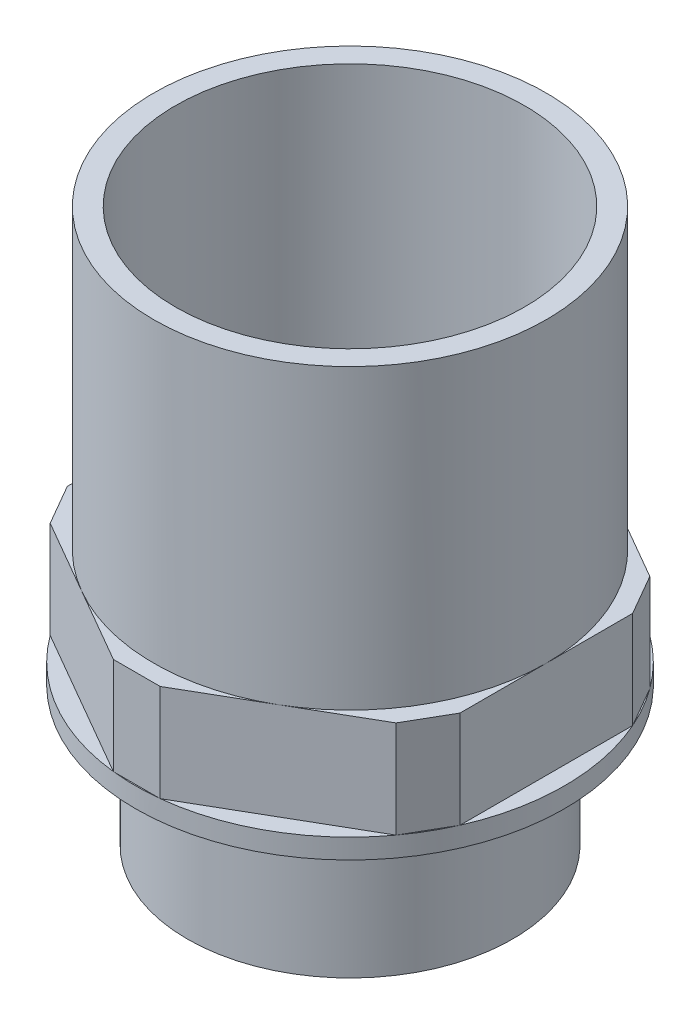
ISO-10303-21;
HEADER;
FILE_DESCRIPTION(('STEP AP214'),'2;1');
FILE_NAME('part.step','',(''),(''),'','','');
FILE_SCHEMA(('AUTOMOTIVE_DESIGN { 1 0 10303 214 1 1 1 1 }'));
ENDSEC;
DATA;
#1=APPLICATION_CONTEXT('core data for automotive mechanical design processes');
#2=APPLICATION_PROTOCOL_DEFINITION('international standard','automotive_design',2000,#1);
#3=PRODUCT_CONTEXT('',#1,'mechanical');
#4=PRODUCT('Part','Part','',(#3));
#5=PRODUCT_RELATED_PRODUCT_CATEGORY('part','',(#4));
#6=PRODUCT_DEFINITION_FORMATION('','',#4);
#7=PRODUCT_DEFINITION_CONTEXT('part definition',#1,'design');
#8=PRODUCT_DEFINITION('design','',#6,#7);
#9=PRODUCT_DEFINITION_SHAPE('','',#8);
#10=(LENGTH_UNIT() NAMED_UNIT(*) SI_UNIT(.MILLI.,.METRE.));
#11=(NAMED_UNIT(*) PLANE_ANGLE_UNIT() SI_UNIT($,.RADIAN.));
#12=(NAMED_UNIT(*) SI_UNIT($,.STERADIAN.) SOLID_ANGLE_UNIT());
#13=UNCERTAINTY_MEASURE_WITH_UNIT(LENGTH_MEASURE(1.E-05),#10,'distance_accuracy_value','');
#14=(GEOMETRIC_REPRESENTATION_CONTEXT(3) GLOBAL_UNCERTAINTY_ASSIGNED_CONTEXT((#13)) GLOBAL_UNIT_ASSIGNED_CONTEXT((#10,
#11,#12)) REPRESENTATION_CONTEXT('',''));
#15=CARTESIAN_POINT('',(0.,0.,0.));
#16=DIRECTION('',(0.,0.,1.));
#17=DIRECTION('',(1.,0.,0.));
#18=AXIS2_PLACEMENT_3D('',#15,#16,#17);
#19=CARTESIAN_POINT('',(-36.2208663317331,32.766,8.12397281117722));
#20=DIRECTION('',(0.,-1.,0.));
#21=DIRECTION('',(0.,0.,-1.));
#22=AXIS2_PLACEMENT_3D('',#19,#20,#21);
#23=PLANE('',#22);
#24=CARTESIAN_POINT('',(0.,32.766,0.));
#25=DIRECTION('',(0.,1.,0.));
#26=DIRECTION('',(0.,0.,1.));
#27=AXIS2_PLACEMENT_3D('',#24,#25,#26);
#28=CIRCLE('',#27,25.146);
#29=CARTESIAN_POINT('',(12.5730000000001,32.766,21.7770748035634));
#30=VERTEX_POINT('',#29);
#31=CARTESIAN_POINT('',(25.146,32.766,0.));
#32=VERTEX_POINT('',#31);
#33=EDGE_CURVE('E43',#30,#32,#28,.T.);
#34=ORIENTED_EDGE('',*,*,#33,.F.);
#35=DIRECTION('',(0.866025403784436,0.,-0.500000000000004));
#36=VECTOR('',#35,1.);
#37=CARTESIAN_POINT('',(22.1497326634662,32.766,16.2479456223541));
#38=LINE('',#37,#36);
#39=CARTESIAN_POINT('',(22.1497326634662,32.766,16.2479456223541));
#40=VERTEX_POINT('',#39);
#41=EDGE_CURVE('E154',#30,#40,#38,.T.);
#42=ORIENTED_EDGE('',*,*,#41,.T.);
#43=DIRECTION('',(0.499999999999998,0.,-0.86602540378444));
#44=VECTOR('',#43,1.);
#45=CARTESIAN_POINT('',(22.1497326634662,32.766,16.2479456223541));
#46=LINE('',#45,#44);
#47=CARTESIAN_POINT('',(25.146,32.766,11.0582583624186));
#48=VERTEX_POINT('',#47);
#49=EDGE_CURVE('E153',#40,#48,#46,.T.);
#50=ORIENTED_EDGE('',*,*,#49,.T.);
#51=DIRECTION('',(0.,0.,-1.));
#52=VECTOR('',#51,1.);
#53=CARTESIAN_POINT('',(25.146,32.766,-11.0582583624186));
#54=LINE('',#53,#52);
#55=EDGE_CURVE('E167',#48,#32,#54,.T.);
#56=ORIENTED_EDGE('',*,*,#55,.T.);
#57=EDGE_LOOP('',(#34,#42,#50,#56));
#58=FACE_BOUND('',#57,.T.);
#59=ADVANCED_FACE('F32',(#58),#23,.F.);
#60=CARTESIAN_POINT('',(12.573,32.766,-21.7770748035635));
#61=VERTEX_POINT('',#60);
#62=EDGE_CURVE('E11',#32,#61,#28,.T.);
#63=ORIENTED_EDGE('',*,*,#62,.F.);
#64=CARTESIAN_POINT('',(25.146,32.766,-11.0582583624186));
#65=VERTEX_POINT('',#64);
#66=EDGE_CURVE('E231',#32,#65,#54,.T.);
#67=ORIENTED_EDGE('',*,*,#66,.T.);
#68=DIRECTION('',(-0.500000000000001,0.,-0.866025403784438));
#69=VECTOR('',#68,1.);
#70=CARTESIAN_POINT('',(22.1497326634661,32.766,-16.2479456223543));
#71=LINE('',#70,#69);
#72=CARTESIAN_POINT('',(22.1497326634661,32.766,-16.2479456223543));
#73=VERTEX_POINT('',#72);
#74=EDGE_CURVE('E233',#65,#73,#71,.T.);
#75=ORIENTED_EDGE('',*,*,#74,.T.);
#76=DIRECTION('',(-0.86602540378444,0.,-0.499999999999998));
#77=VECTOR('',#76,1.);
#78=CARTESIAN_POINT('',(2.99626733653379,32.766,-27.3062039847728));
#79=LINE('',#78,#77);
#80=EDGE_CURVE('E236',#73,#61,#79,.T.);
#81=ORIENTED_EDGE('',*,*,#80,.T.);
#82=EDGE_LOOP('',(#63,#67,#75,#81));
#83=FACE_BOUND('',#82,.T.);
#84=ADVANCED_FACE('F305',(#83),#23,.F.);
#85=CARTESIAN_POINT('',(-12.5730000000001,32.766,-21.7770748035634));
#86=VERTEX_POINT('',#85);
#87=EDGE_CURVE('E41',#61,#86,#28,.T.);
#88=ORIENTED_EDGE('',*,*,#87,.F.);
#89=CARTESIAN_POINT('',(2.99626733653379,32.766,-27.3062039847728));
#90=VERTEX_POINT('',#89);
#91=EDGE_CURVE('E235',#61,#90,#79,.T.);
#92=ORIENTED_EDGE('',*,*,#91,.T.);
#93=DIRECTION('',(-1.,0.,0.));
#94=VECTOR('',#93,1.);
#95=CARTESIAN_POINT('',(-2.99626733653402,32.766,-27.3062039847728));
#96=LINE('',#95,#94);
#97=CARTESIAN_POINT('',(-2.99626733653402,32.766,-27.3062039847728));
#98=VERTEX_POINT('',#97);
#99=EDGE_CURVE('E239',#90,#98,#96,.T.);
#100=ORIENTED_EDGE('',*,*,#99,.T.);
#101=DIRECTION('',(-0.866025403784436,0.,0.500000000000005));
#102=VECTOR('',#101,1.);
#103=CARTESIAN_POINT('',(-2.99626733653402,32.766,-27.3062039847728));
#104=LINE('',#103,#102);
#105=EDGE_CURVE('E242',#98,#86,#104,.T.);
#106=ORIENTED_EDGE('',*,*,#105,.T.);
#107=EDGE_LOOP('',(#88,#92,#100,#106));
#108=FACE_BOUND('',#107,.T.);
#109=ADVANCED_FACE('F310',(#108),#23,.F.);
#110=CARTESIAN_POINT('',(-25.146,32.766,0.));
#111=VERTEX_POINT('',#110);
#112=EDGE_CURVE('E50',#86,#111,#28,.T.);
#113=ORIENTED_EDGE('',*,*,#112,.F.);
#114=CARTESIAN_POINT('',(-22.1497326634662,32.766,-16.2479456223541));
#115=VERTEX_POINT('',#114);
#116=EDGE_CURVE('E241',#86,#115,#104,.T.);
#117=ORIENTED_EDGE('',*,*,#116,.T.);
#118=DIRECTION('',(-0.499999999999997,0.,0.86602540378444));
#119=VECTOR('',#118,1.);
#120=CARTESIAN_POINT('',(-25.146,32.766,-11.0582583624186));
#121=LINE('',#120,#119);
#122=CARTESIAN_POINT('',(-25.146,32.766,-11.0582583624186));
#123=VERTEX_POINT('',#122);
#124=EDGE_CURVE('E217',#115,#123,#121,.T.);
#125=ORIENTED_EDGE('',*,*,#124,.T.);
#126=DIRECTION('',(0.,0.,1.));
#127=VECTOR('',#126,1.);
#128=CARTESIAN_POINT('',(-25.146,32.766,-11.0582583624186));
#129=LINE('',#128,#127);
#130=EDGE_CURVE('E221',#123,#111,#129,.T.);
#131=ORIENTED_EDGE('',*,*,#130,.T.);
#132=EDGE_LOOP('',(#113,#117,#125,#131));
#133=FACE_BOUND('',#132,.T.);
#134=ADVANCED_FACE('F325',(#133),#23,.F.);
#135=CARTESIAN_POINT('',(-12.573,32.766,21.7770748035636));
#136=VERTEX_POINT('',#135);
#137=EDGE_CURVE('E173',#111,#136,#28,.T.);
#138=ORIENTED_EDGE('',*,*,#137,.F.);
#139=CARTESIAN_POINT('',(-25.146,32.766,11.0582583624186));
#140=VERTEX_POINT('',#139);
#141=EDGE_CURVE('E220',#111,#140,#129,.T.);
#142=ORIENTED_EDGE('',*,*,#141,.T.);
#143=DIRECTION('',(0.5,0.,0.866025403784438));
#144=VECTOR('',#143,1.);
#145=CARTESIAN_POINT('',(-25.146,32.766,11.0582583624186));
#146=LINE('',#145,#144);
#147=CARTESIAN_POINT('',(-22.1497326634661,32.766,16.2479456223543));
#148=VERTEX_POINT('',#147);
#149=EDGE_CURVE('E223',#140,#148,#146,.T.);
#150=ORIENTED_EDGE('',*,*,#149,.T.);
#151=DIRECTION('',(0.86602540378444,0.,0.499999999999998));
#152=VECTOR('',#151,1.);
#153=CARTESIAN_POINT('',(-22.1497326634661,32.766,16.2479456223543));
#154=LINE('',#153,#152);
#155=EDGE_CURVE('E226',#148,#136,#154,.T.);
#156=ORIENTED_EDGE('',*,*,#155,.T.);
#157=EDGE_LOOP('',(#138,#142,#150,#156));
#158=FACE_BOUND('',#157,.T.);
#159=ADVANCED_FACE('F316',(#158),#23,.F.);
#160=EDGE_CURVE('E146',#136,#30,#28,.T.);
#161=ORIENTED_EDGE('',*,*,#160,.F.);
#162=CARTESIAN_POINT('',(-2.99626733653379,32.766,27.3062039847728));
#163=VERTEX_POINT('',#162);
#164=EDGE_CURVE('E225',#136,#163,#154,.T.);
#165=ORIENTED_EDGE('',*,*,#164,.T.);
#166=DIRECTION('',(1.,0.,0.));
#167=VECTOR('',#166,1.);
#168=CARTESIAN_POINT('',(-2.99626733653379,32.766,27.3062039847728));
#169=LINE('',#168,#167);
#170=CARTESIAN_POINT('',(2.99626733653397,32.766,27.3062039847728));
#171=VERTEX_POINT('',#170);
#172=EDGE_CURVE('E149',#163,#171,#169,.T.);
#173=ORIENTED_EDGE('',*,*,#172,.T.);
#174=EDGE_CURVE('E142',#171,#30,#38,.T.);
#175=ORIENTED_EDGE('',*,*,#174,.T.);
#176=EDGE_LOOP('',(#161,#165,#173,#175));
#177=FACE_BOUND('',#176,.T.);
#178=ADVANCED_FACE('F144',(#177),#23,.F.);
#179=CARTESIAN_POINT('',(0.,20.32,0.));
#180=DIRECTION('',(0.,1.,0.));
#181=DIRECTION('',(0.,0.,1.));
#182=AXIS2_PLACEMENT_3D('',#179,#180,#181);
#183=PLANE('',#182);
#184=DIRECTION('',(-0.499999999999997,0.,0.86602540378444));
#185=VECTOR('',#184,1.);
#186=CARTESIAN_POINT('',(-25.146,20.32,-11.0582583624186));
#187=LINE('',#186,#185);
#188=CARTESIAN_POINT('',(-22.1497326634662,20.32,-16.2479456223542));
#189=VERTEX_POINT('',#188);
#190=CARTESIAN_POINT('',(-25.146,20.32,-11.0582583624186));
#191=VERTEX_POINT('',#190);
#192=EDGE_CURVE('E182',#189,#191,#187,.T.);
#193=ORIENTED_EDGE('',*,*,#192,.F.);
#194=CARTESIAN_POINT('',(0.,20.32,0.));
#195=DIRECTION('',(0.,1.,0.));
#196=DIRECTION('',(0.,0.,1.));
#197=AXIS2_PLACEMENT_3D('',#194,#195,#196);
#198=CIRCLE('',#197,27.4701);
#199=EDGE_CURVE('E679',#189,#191,#198,.T.);
#200=ORIENTED_EDGE('',*,*,#199,.T.);
#201=EDGE_LOOP('',(#193,#200));
#202=FACE_BOUND('',#201,.T.);
#203=ADVANCED_FACE('F315',(#202),#183,.T.);
#204=DIRECTION('',(-0.866025403784436,0.,0.500000000000005));
#205=VECTOR('',#204,1.);
#206=CARTESIAN_POINT('',(-2.99626733653402,20.32,-27.3062039847728));
#207=LINE('',#206,#205);
#208=CARTESIAN_POINT('',(-2.9962673365339,20.32,-27.3062039847728));
#209=VERTEX_POINT('',#208);
#210=EDGE_CURVE('E214',#209,#189,#207,.T.);
#211=ORIENTED_EDGE('',*,*,#210,.F.);
#212=EDGE_CURVE('E682',#209,#189,#198,.T.);
#213=ORIENTED_EDGE('',*,*,#212,.T.);
#214=EDGE_LOOP('',(#211,#213));
#215=FACE_BOUND('',#214,.T.);
#216=ADVANCED_FACE('F321',(#215),#183,.T.);
#217=DIRECTION('',(-1.,0.,0.));
#218=VECTOR('',#217,1.);
#219=CARTESIAN_POINT('',(-2.99626733653402,20.32,-27.3062039847728));
#220=LINE('',#219,#218);
#221=CARTESIAN_POINT('',(2.99626733653379,20.32,-27.3062039847728));
#222=VERTEX_POINT('',#221);
#223=EDGE_CURVE('E211',#222,#209,#220,.T.);
#224=ORIENTED_EDGE('',*,*,#223,.F.);
#225=EDGE_CURVE('E685',#222,#209,#198,.T.);
#226=ORIENTED_EDGE('',*,*,#225,.T.);
#227=EDGE_LOOP('',(#224,#226));
#228=FACE_BOUND('',#227,.T.);
#229=ADVANCED_FACE('F592',(#228),#183,.T.);
#230=DIRECTION('',(-0.86602540378444,0.,-0.499999999999998));
#231=VECTOR('',#230,1.);
#232=CARTESIAN_POINT('',(2.99626733653379,20.32,-27.3062039847728));
#233=LINE('',#232,#231);
#234=CARTESIAN_POINT('',(22.1497326634661,20.32,-16.2479456223543));
#235=VERTEX_POINT('',#234);
#236=EDGE_CURVE('E208',#235,#222,#233,.T.);
#237=ORIENTED_EDGE('',*,*,#236,.F.);
#238=EDGE_CURVE('E688',#235,#222,#198,.T.);
#239=ORIENTED_EDGE('',*,*,#238,.T.);
#240=EDGE_LOOP('',(#237,#239));
#241=FACE_BOUND('',#240,.T.);
#242=ADVANCED_FACE('F600',(#241),#183,.T.);
#243=DIRECTION('',(-0.500000000000001,0.,-0.866025403784438));
#244=VECTOR('',#243,1.);
#245=CARTESIAN_POINT('',(22.1497326634661,20.32,-16.2479456223543));
#246=LINE('',#245,#244);
#247=CARTESIAN_POINT('',(25.146,20.32,-11.0582583624186));
#248=VERTEX_POINT('',#247);
#249=EDGE_CURVE('E205',#248,#235,#246,.T.);
#250=ORIENTED_EDGE('',*,*,#249,.F.);
#251=EDGE_CURVE('E691',#248,#235,#198,.T.);
#252=ORIENTED_EDGE('',*,*,#251,.T.);
#253=EDGE_LOOP('',(#250,#252));
#254=FACE_BOUND('',#253,.T.);
#255=ADVANCED_FACE('F608',(#254),#183,.T.);
#256=DIRECTION('',(0.,0.,-1.));
#257=VECTOR('',#256,1.);
#258=CARTESIAN_POINT('',(25.146,20.32,-11.0582583624186));
#259=LINE('',#258,#257);
#260=CARTESIAN_POINT('',(25.146,20.32,11.0582583624186));
#261=VERTEX_POINT('',#260);
#262=EDGE_CURVE('E202',#261,#248,#259,.T.);
#263=ORIENTED_EDGE('',*,*,#262,.F.);
#264=EDGE_CURVE('E387',#261,#248,#198,.T.);
#265=ORIENTED_EDGE('',*,*,#264,.T.);
#266=EDGE_LOOP('',(#263,#265));
#267=FACE_BOUND('',#266,.T.);
#268=ADVANCED_FACE('F397',(#267),#183,.T.);
#269=DIRECTION('',(0.499999999999998,0.,-0.86602540378444));
#270=VECTOR('',#269,1.);
#271=CARTESIAN_POINT('',(22.1497326634662,20.32,16.2479456223541));
#272=LINE('',#271,#270);
#273=CARTESIAN_POINT('',(22.1497326634662,20.32,16.2479456223541));
#274=VERTEX_POINT('',#273);
#275=EDGE_CURVE('E199',#274,#261,#272,.T.);
#276=ORIENTED_EDGE('',*,*,#275,.F.);
#277=EDGE_CURVE('E284',#274,#261,#198,.T.);
#278=ORIENTED_EDGE('',*,*,#277,.T.);
#279=EDGE_LOOP('',(#276,#278));
#280=FACE_BOUND('',#279,.T.);
#281=ADVANCED_FACE('F379',(#280),#183,.T.);
#282=DIRECTION('',(0.866025403784436,0.,-0.500000000000004));
#283=VECTOR('',#282,1.);
#284=CARTESIAN_POINT('',(22.1497326634662,20.32,16.2479456223541));
#285=LINE('',#284,#283);
#286=CARTESIAN_POINT('',(2.99626733653395,20.32,27.3062039847728));
#287=VERTEX_POINT('',#286);
#288=EDGE_CURVE('E197',#287,#274,#285,.T.);
#289=ORIENTED_EDGE('',*,*,#288,.F.);
#290=EDGE_CURVE('E281',#287,#274,#198,.T.);
#291=ORIENTED_EDGE('',*,*,#290,.T.);
#292=EDGE_LOOP('',(#289,#291));
#293=FACE_BOUND('',#292,.T.);
#294=ADVANCED_FACE('F388',(#293),#183,.T.);
#295=DIRECTION('',(1.,0.,0.));
#296=VECTOR('',#295,1.);
#297=CARTESIAN_POINT('',(-2.99626733653379,20.32,27.3062039847728));
#298=LINE('',#297,#296);
#299=CARTESIAN_POINT('',(-2.99626733653382,20.32,27.3062039847728));
#300=VERTEX_POINT('',#299);
#301=EDGE_CURVE('E194',#300,#287,#298,.T.);
#302=ORIENTED_EDGE('',*,*,#301,.F.);
#303=EDGE_CURVE('E280',#300,#287,#198,.T.);
#304=ORIENTED_EDGE('',*,*,#303,.T.);
#305=EDGE_LOOP('',(#302,#304));
#306=FACE_BOUND('',#305,.T.);
#307=ADVANCED_FACE('F390',(#306),#183,.T.);
#308=DIRECTION('',(0.86602540378444,0.,0.499999999999998));
#309=VECTOR('',#308,1.);
#310=CARTESIAN_POINT('',(-22.1497326634661,20.32,16.2479456223543));
#311=LINE('',#310,#309);
#312=CARTESIAN_POINT('',(-22.1497326634661,20.32,16.2479456223542));
#313=VERTEX_POINT('',#312);
#314=EDGE_CURVE('E191',#313,#300,#311,.T.);
#315=ORIENTED_EDGE('',*,*,#314,.F.);
#316=EDGE_CURVE('E678',#313,#300,#198,.T.);
#317=ORIENTED_EDGE('',*,*,#316,.T.);
#318=EDGE_LOOP('',(#315,#317));
#319=FACE_BOUND('',#318,.T.);
#320=ADVANCED_FACE('F395',(#319),#183,.T.);
#321=DIRECTION('',(0.5,0.,0.866025403784438));
#322=VECTOR('',#321,1.);
#323=CARTESIAN_POINT('',(-25.146,20.32,11.0582583624186));
#324=LINE('',#323,#322);
#325=CARTESIAN_POINT('',(-25.146,20.32,11.0582583624186));
#326=VERTEX_POINT('',#325);
#327=EDGE_CURVE('E188',#326,#313,#324,.T.);
#328=ORIENTED_EDGE('',*,*,#327,.F.);
#329=EDGE_CURVE('E675',#326,#313,#198,.T.);
#330=ORIENTED_EDGE('',*,*,#329,.T.);
#331=EDGE_LOOP('',(#328,#330));
#332=FACE_BOUND('',#331,.T.);
#333=ADVANCED_FACE('F300',(#332),#183,.T.);
#334=CARTESIAN_POINT('',(0.,17.78,0.));
#335=DIRECTION('',(0.,-1.,0.));
#336=DIRECTION('',(0.,0.,-1.));
#337=AXIS2_PLACEMENT_3D('',#334,#335,#336);
#338=CYLINDRICAL_SURFACE('',#337,20.828);
#339=CARTESIAN_POINT('',(0.,17.78,0.));
#340=DIRECTION('',(0.,1.,0.));
#341=DIRECTION('',(0.,0.,1.));
#342=AXIS2_PLACEMENT_3D('',#339,#340,#341);
#343=CIRCLE('',#342,20.828);
#344=CARTESIAN_POINT('',(0.,17.78,20.828));
#345=VERTEX_POINT('',#344);
#346=EDGE_CURVE('E174',#345,#345,#343,.T.);
#347=ORIENTED_EDGE('',*,*,#346,.F.);
#348=EDGE_LOOP('',(#347));
#349=FACE_BOUND('',#348,.T.);
#350=CARTESIAN_POINT('',(0.,0.,0.));
#351=DIRECTION('',(0.,1.,0.));
#352=DIRECTION('',(0.,0.,1.));
#353=AXIS2_PLACEMENT_3D('',#350,#351,#352);
#354=CIRCLE('',#353,20.828);
#355=CARTESIAN_POINT('',(0.,0.,20.828));
#356=VERTEX_POINT('',#355);
#357=EDGE_CURVE('E176',#356,#356,#354,.T.);
#358=ORIENTED_EDGE('',*,*,#357,.T.);
#359=EDGE_LOOP('',(#358));
#360=FACE_BOUND('',#359,.T.);
#361=ADVANCED_FACE('F34',(#349,#360),#338,.T.);
#362=CARTESIAN_POINT('',(0.,0.,0.));
#363=DIRECTION('',(0.,1.,0.));
#364=DIRECTION('',(0.,0.,1.));
#365=AXIS2_PLACEMENT_3D('',#362,#363,#364);
#366=PLANE('',#365);
#367=CARTESIAN_POINT('',(0.,0.,0.));
#368=DIRECTION('',(0.,-1.,0.));
#369=DIRECTION('',(0.,0.,-1.));
#370=AXIS2_PLACEMENT_3D('',#367,#368,#369);
#371=CIRCLE('',#370,17.145);
#372=CARTESIAN_POINT('',(0.,0.,-17.145));
#373=VERTEX_POINT('',#372);
#374=EDGE_CURVE('E708',#373,#373,#371,.T.);
#375=ORIENTED_EDGE('',*,*,#374,.F.);
#376=EDGE_LOOP('',(#375));
#377=FACE_BOUND('',#376,.T.);
#378=ORIENTED_EDGE('',*,*,#357,.F.);
#379=EDGE_LOOP('',(#378));
#380=FACE_BOUND('',#379,.T.);
#381=ADVANCED_FACE('F289',(#377,#380),#366,.F.);
#382=CARTESIAN_POINT('',(0.,17.78,0.));
#383=DIRECTION('',(0.,1.,0.));
#384=DIRECTION('',(0.,0.,1.));
#385=AXIS2_PLACEMENT_3D('',#382,#383,#384);
#386=PLANE('',#385);
#387=CARTESIAN_POINT('',(0.,17.78,0.));
#388=DIRECTION('',(0.,1.,0.));
#389=DIRECTION('',(0.,0.,1.));
#390=AXIS2_PLACEMENT_3D('',#387,#388,#389);
#391=CIRCLE('',#390,27.4701);
#392=CARTESIAN_POINT('',(0.,17.78,27.4701));
#393=VERTEX_POINT('',#392);
#394=EDGE_CURVE('E277',#393,#393,#391,.T.);
#395=ORIENTED_EDGE('',*,*,#394,.F.);
#396=EDGE_LOOP('',(#395));
#397=FACE_BOUND('',#396,.T.);
#398=ORIENTED_EDGE('',*,*,#346,.T.);
#399=EDGE_LOOP('',(#398));
#400=FACE_BOUND('',#399,.T.);
#401=ADVANCED_FACE('F291',(#397,#400),#386,.F.);
#402=CARTESIAN_POINT('',(0.,20.32,0.));
#403=DIRECTION('',(0.,-1.,0.));
#404=DIRECTION('',(0.,0.,-1.));
#405=AXIS2_PLACEMENT_3D('',#402,#403,#404);
#406=CYLINDRICAL_SURFACE('',#405,27.4701);
#407=ORIENTED_EDGE('',*,*,#290,.F.);
#408=ORIENTED_EDGE('',*,*,#303,.F.);
#409=ORIENTED_EDGE('',*,*,#316,.F.);
#410=ORIENTED_EDGE('',*,*,#329,.F.);
#411=EDGE_CURVE('E677',#191,#326,#198,.T.);
#412=ORIENTED_EDGE('',*,*,#411,.F.);
#413=ORIENTED_EDGE('',*,*,#199,.F.);
#414=ORIENTED_EDGE('',*,*,#212,.F.);
#415=ORIENTED_EDGE('',*,*,#225,.F.);
#416=ORIENTED_EDGE('',*,*,#238,.F.);
#417=ORIENTED_EDGE('',*,*,#251,.F.);
#418=ORIENTED_EDGE('',*,*,#264,.F.);
#419=ORIENTED_EDGE('',*,*,#277,.F.);
#420=EDGE_LOOP('',(#407,#408,#409,#410,#412,#413,#414,#415,#416,#417,#418,#419));
#421=FACE_BOUND('',#420,.T.);
#422=ORIENTED_EDGE('',*,*,#394,.T.);
#423=EDGE_LOOP('',(#422));
#424=FACE_BOUND('',#423,.T.);
#425=ADVANCED_FACE('F297',(#421,#424),#406,.T.);
#426=DIRECTION('',(0.,0.,1.));
#427=VECTOR('',#426,1.);
#428=CARTESIAN_POINT('',(-25.146,20.32,-11.0582583624186));
#429=LINE('',#428,#427);
#430=EDGE_CURVE('E185',#191,#326,#429,.T.);
#431=ORIENTED_EDGE('',*,*,#430,.F.);
#432=ORIENTED_EDGE('',*,*,#411,.T.);
#433=EDGE_LOOP('',(#431,#432));
#434=FACE_BOUND('',#433,.T.);
#435=ADVANCED_FACE('F324',(#434),#183,.T.);
#436=CARTESIAN_POINT('',(-25.146,32.766,-11.0582583624186));
#437=DIRECTION('',(0.86602540378444,0.,0.499999999999997));
#438=DIRECTION('',(0.499999999999997,0.,-0.86602540378444));
#439=AXIS2_PLACEMENT_3D('',#436,#437,#438);
#440=PLANE('',#439);
#441=ORIENTED_EDGE('',*,*,#192,.T.);
#442=DIRECTION('',(0.,-1.,0.));
#443=VECTOR('',#442,1.);
#444=CARTESIAN_POINT('',(-25.146,32.766,-11.0582583624186));
#445=LINE('',#444,#443);
#446=EDGE_CURVE('E274',#123,#191,#445,.T.);
#447=ORIENTED_EDGE('',*,*,#446,.F.);
#448=ORIENTED_EDGE('',*,*,#124,.F.);
#449=DIRECTION('',(0.,-1.,0.));
#450=VECTOR('',#449,1.);
#451=CARTESIAN_POINT('',(-22.1497326634662,32.766,-16.2479456223541));
#452=LINE('',#451,#450);
#453=EDGE_CURVE('E244',#115,#189,#452,.T.);
#454=ORIENTED_EDGE('',*,*,#453,.T.);
#455=EDGE_LOOP('',(#441,#447,#448,#454));
#456=FACE_BOUND('',#455,.T.);
#457=ADVANCED_FACE('F359',(#456),#440,.F.);
#458=CARTESIAN_POINT('',(-25.146,32.766,-11.0582583624186));
#459=DIRECTION('',(1.,0.,0.));
#460=DIRECTION('',(0.,0.,-1.));
#461=AXIS2_PLACEMENT_3D('',#458,#459,#460);
#462=PLANE('',#461);
#463=ORIENTED_EDGE('',*,*,#430,.T.);
#464=DIRECTION('',(0.,-1.,0.));
#465=VECTOR('',#464,1.);
#466=CARTESIAN_POINT('',(-25.146,32.766,11.0582583624186));
#467=LINE('',#466,#465);
#468=EDGE_CURVE('E271',#140,#326,#467,.T.);
#469=ORIENTED_EDGE('',*,*,#468,.F.);
#470=ORIENTED_EDGE('',*,*,#141,.F.);
#471=ORIENTED_EDGE('',*,*,#130,.F.);
#472=ORIENTED_EDGE('',*,*,#446,.T.);
#473=EDGE_LOOP('',(#463,#469,#470,#471,#472));
#474=FACE_BOUND('',#473,.T.);
#475=ADVANCED_FACE('F334',(#474),#462,.F.);
#476=CARTESIAN_POINT('',(-25.146,32.766,11.0582583624186));
#477=DIRECTION('',(0.866025403784438,0.,-0.5));
#478=DIRECTION('',(-0.5,0.,-0.866025403784439));
#479=AXIS2_PLACEMENT_3D('',#476,#477,#478);
#480=PLANE('',#479);
#481=ORIENTED_EDGE('',*,*,#327,.T.);
#482=DIRECTION('',(0.,-1.,0.));
#483=VECTOR('',#482,1.);
#484=CARTESIAN_POINT('',(-22.1497326634661,32.766,16.2479456223543));
#485=LINE('',#484,#483);
#486=EDGE_CURVE('E268',#148,#313,#485,.T.);
#487=ORIENTED_EDGE('',*,*,#486,.F.);
#488=ORIENTED_EDGE('',*,*,#149,.F.);
#489=ORIENTED_EDGE('',*,*,#468,.T.);
#490=EDGE_LOOP('',(#481,#487,#488,#489));
#491=FACE_BOUND('',#490,.T.);
#492=ADVANCED_FACE('F363',(#491),#480,.F.);
#493=CARTESIAN_POINT('',(-22.1497326634661,32.766,16.2479456223543));
#494=DIRECTION('',(0.499999999999998,0.,-0.86602540378444));
#495=DIRECTION('',(-0.86602540378444,0.,-0.499999999999998));
#496=AXIS2_PLACEMENT_3D('',#493,#494,#495);
#497=PLANE('',#496);
#498=ORIENTED_EDGE('',*,*,#314,.T.);
#499=DIRECTION('',(0.,-1.,0.));
#500=VECTOR('',#499,1.);
#501=CARTESIAN_POINT('',(-2.99626733653379,32.766,27.3062039847728));
#502=LINE('',#501,#500);
#503=EDGE_CURVE('E265',#163,#300,#502,.T.);
#504=ORIENTED_EDGE('',*,*,#503,.F.);
#505=ORIENTED_EDGE('',*,*,#164,.F.);
#506=ORIENTED_EDGE('',*,*,#155,.F.);
#507=ORIENTED_EDGE('',*,*,#486,.T.);
#508=EDGE_LOOP('',(#498,#504,#505,#506,#507));
#509=FACE_BOUND('',#508,.T.);
#510=ADVANCED_FACE('F367',(#509),#497,.F.);
#511=CARTESIAN_POINT('',(-2.99626733653379,32.766,27.3062039847728));
#512=DIRECTION('',(0.,0.,-1.));
#513=DIRECTION('',(-1.,0.,0.));
#514=AXIS2_PLACEMENT_3D('',#511,#512,#513);
#515=PLANE('',#514);
#516=ORIENTED_EDGE('',*,*,#301,.T.);
#517=DIRECTION('',(0.,-1.,0.));
#518=VECTOR('',#517,1.);
#519=CARTESIAN_POINT('',(2.99626733653397,32.766,27.3062039847728));
#520=LINE('',#519,#518);
#521=EDGE_CURVE('E263',#171,#287,#520,.T.);
#522=ORIENTED_EDGE('',*,*,#521,.F.);
#523=ORIENTED_EDGE('',*,*,#172,.F.);
#524=ORIENTED_EDGE('',*,*,#503,.T.);
#525=EDGE_LOOP('',(#516,#522,#523,#524));
#526=FACE_BOUND('',#525,.T.);
#527=ADVANCED_FACE('F370',(#526),#515,.F.);
#528=CARTESIAN_POINT('',(22.1497326634662,32.766,16.2479456223541));
#529=DIRECTION('',(-0.500000000000004,0.,-0.866025403784436));
#530=DIRECTION('',(-0.866025403784436,0.,0.500000000000004));
#531=AXIS2_PLACEMENT_3D('',#528,#529,#530);
#532=PLANE('',#531);
#533=ORIENTED_EDGE('',*,*,#288,.T.);
#534=DIRECTION('',(0.,-1.,0.));
#535=VECTOR('',#534,1.);
#536=CARTESIAN_POINT('',(22.1497326634662,32.766,16.2479456223541));
#537=LINE('',#536,#535);
#538=EDGE_CURVE('E161',#40,#274,#537,.T.);
#539=ORIENTED_EDGE('',*,*,#538,.F.);
#540=ORIENTED_EDGE('',*,*,#41,.F.);
#541=ORIENTED_EDGE('',*,*,#174,.F.);
#542=ORIENTED_EDGE('',*,*,#521,.T.);
#543=EDGE_LOOP('',(#533,#539,#540,#541,#542));
#544=FACE_BOUND('',#543,.T.);
#545=ADVANCED_FACE('F159',(#544),#532,.F.);
#546=CARTESIAN_POINT('',(22.1497326634662,32.766,16.2479456223541));
#547=DIRECTION('',(-0.86602540378444,0.,-0.499999999999998));
#548=DIRECTION('',(-0.499999999999998,0.,0.86602540378444));
#549=AXIS2_PLACEMENT_3D('',#546,#547,#548);
#550=PLANE('',#549);
#551=ORIENTED_EDGE('',*,*,#275,.T.);
#552=DIRECTION('',(0.,-1.,0.));
#553=VECTOR('',#552,1.);
#554=CARTESIAN_POINT('',(25.146,32.766,11.0582583624186));
#555=LINE('',#554,#553);
#556=EDGE_CURVE('E259',#48,#261,#555,.T.);
#557=ORIENTED_EDGE('',*,*,#556,.F.);
#558=ORIENTED_EDGE('',*,*,#49,.F.);
#559=ORIENTED_EDGE('',*,*,#538,.T.);
#560=EDGE_LOOP('',(#551,#557,#558,#559));
#561=FACE_BOUND('',#560,.T.);
#562=ADVANCED_FACE('F374',(#561),#550,.F.);
#563=CARTESIAN_POINT('',(25.146,32.766,-11.0582583624186));
#564=DIRECTION('',(-1.,0.,0.));
#565=DIRECTION('',(0.,0.,1.));
#566=AXIS2_PLACEMENT_3D('',#563,#564,#565);
#567=PLANE('',#566);
#568=ORIENTED_EDGE('',*,*,#262,.T.);
#569=DIRECTION('',(0.,-1.,0.));
#570=VECTOR('',#569,1.);
#571=CARTESIAN_POINT('',(25.146,32.766,-11.0582583624186));
#572=LINE('',#571,#570);
#573=EDGE_CURVE('E256',#65,#248,#572,.T.);
#574=ORIENTED_EDGE('',*,*,#573,.F.);
#575=ORIENTED_EDGE('',*,*,#66,.F.);
#576=ORIENTED_EDGE('',*,*,#55,.F.);
#577=ORIENTED_EDGE('',*,*,#556,.T.);
#578=EDGE_LOOP('',(#568,#574,#575,#576,#577));
#579=FACE_BOUND('',#578,.T.);
#580=ADVANCED_FACE('F342',(#579),#567,.F.);
#581=CARTESIAN_POINT('',(22.1497326634661,32.766,-16.2479456223543));
#582=DIRECTION('',(-0.866025403784438,0.,0.500000000000001));
#583=DIRECTION('',(0.500000000000001,0.,0.866025403784438));
#584=AXIS2_PLACEMENT_3D('',#581,#582,#583);
#585=PLANE('',#584);
#586=ORIENTED_EDGE('',*,*,#249,.T.);
#587=DIRECTION('',(0.,-1.,0.));
#588=VECTOR('',#587,1.);
#589=CARTESIAN_POINT('',(22.1497326634661,32.766,-16.2479456223543));
#590=LINE('',#589,#588);
#591=EDGE_CURVE('E253',#73,#235,#590,.T.);
#592=ORIENTED_EDGE('',*,*,#591,.F.);
#593=ORIENTED_EDGE('',*,*,#74,.F.);
#594=ORIENTED_EDGE('',*,*,#573,.T.);
#595=EDGE_LOOP('',(#586,#592,#593,#594));
#596=FACE_BOUND('',#595,.T.);
#597=ADVANCED_FACE('F346',(#596),#585,.F.);
#598=CARTESIAN_POINT('',(2.99626733653379,32.766,-27.3062039847728));
#599=DIRECTION('',(-0.499999999999998,0.,0.86602540378444));
#600=DIRECTION('',(0.86602540378444,0.,0.499999999999998));
#601=AXIS2_PLACEMENT_3D('',#598,#599,#600);
#602=PLANE('',#601);
#603=ORIENTED_EDGE('',*,*,#236,.T.);
#604=DIRECTION('',(0.,-1.,0.));
#605=VECTOR('',#604,1.);
#606=CARTESIAN_POINT('',(2.99626733653379,32.766,-27.3062039847728));
#607=LINE('',#606,#605);
#608=EDGE_CURVE('E250',#90,#222,#607,.T.);
#609=ORIENTED_EDGE('',*,*,#608,.F.);
#610=ORIENTED_EDGE('',*,*,#91,.F.);
#611=ORIENTED_EDGE('',*,*,#80,.F.);
#612=ORIENTED_EDGE('',*,*,#591,.T.);
#613=EDGE_LOOP('',(#603,#609,#610,#611,#612));
#614=FACE_BOUND('',#613,.T.);
#615=ADVANCED_FACE('F348',(#614),#602,.F.);
#616=CARTESIAN_POINT('',(-2.99626733653402,32.766,-27.3062039847728));
#617=DIRECTION('',(0.,0.,1.));
#618=DIRECTION('',(1.,0.,0.));
#619=AXIS2_PLACEMENT_3D('',#616,#617,#618);
#620=PLANE('',#619);
#621=ORIENTED_EDGE('',*,*,#223,.T.);
#622=DIRECTION('',(0.,-1.,0.));
#623=VECTOR('',#622,1.);
#624=CARTESIAN_POINT('',(-2.99626733653402,32.766,-27.3062039847728));
#625=LINE('',#624,#623);
#626=EDGE_CURVE('E247',#98,#209,#625,.T.);
#627=ORIENTED_EDGE('',*,*,#626,.F.);
#628=ORIENTED_EDGE('',*,*,#99,.F.);
#629=ORIENTED_EDGE('',*,*,#608,.T.);
#630=EDGE_LOOP('',(#621,#627,#628,#629));
#631=FACE_BOUND('',#630,.T.);
#632=ADVANCED_FACE('F354',(#631),#620,.F.);
#633=CARTESIAN_POINT('',(-2.99626733653402,32.766,-27.3062039847728));
#634=DIRECTION('',(0.500000000000005,0.,0.866025403784436));
#635=DIRECTION('',(0.866025403784436,0.,-0.500000000000005));
#636=AXIS2_PLACEMENT_3D('',#633,#634,#635);
#637=PLANE('',#636);
#638=ORIENTED_EDGE('',*,*,#210,.T.);
#639=ORIENTED_EDGE('',*,*,#453,.F.);
#640=ORIENTED_EDGE('',*,*,#116,.F.);
#641=ORIENTED_EDGE('',*,*,#105,.F.);
#642=ORIENTED_EDGE('',*,*,#626,.T.);
#643=EDGE_LOOP('',(#638,#639,#640,#641,#642));
#644=FACE_BOUND('',#643,.T.);
#645=ADVANCED_FACE('F356',(#644),#637,.F.);
#646=CARTESIAN_POINT('',(0.,70.866,0.));
#647=DIRECTION('',(0.,-1.,0.));
#648=DIRECTION('',(0.,0.,-1.));
#649=AXIS2_PLACEMENT_3D('',#646,#647,#648);
#650=CYLINDRICAL_SURFACE('',#649,25.146);
#651=CARTESIAN_POINT('',(0.,70.866,0.));
#652=DIRECTION('',(0.,1.,0.));
#653=DIRECTION('',(0.,0.,1.));
#654=AXIS2_PLACEMENT_3D('',#651,#652,#653);
#655=CIRCLE('',#654,25.146);
#656=CARTESIAN_POINT('',(0.,70.866,25.146));
#657=VERTEX_POINT('',#656);
#658=EDGE_CURVE('E169',#657,#657,#655,.T.);
#659=ORIENTED_EDGE('',*,*,#658,.F.);
#660=EDGE_LOOP('',(#659));
#661=FACE_BOUND('',#660,.T.);
#662=ORIENTED_EDGE('',*,*,#33,.T.);
#663=ORIENTED_EDGE('',*,*,#62,.T.);
#664=ORIENTED_EDGE('',*,*,#87,.T.);
#665=ORIENTED_EDGE('',*,*,#112,.T.);
#666=ORIENTED_EDGE('',*,*,#137,.T.);
#667=ORIENTED_EDGE('',*,*,#160,.T.);
#668=EDGE_LOOP('',(#662,#663,#664,#665,#666,#667));
#669=FACE_BOUND('',#668,.T.);
#670=ADVANCED_FACE('F172',(#661,#669),#650,.T.);
#671=CARTESIAN_POINT('',(0.,70.866,0.));
#672=DIRECTION('',(0.,1.,0.));
#673=DIRECTION('',(0.,0.,1.));
#674=AXIS2_PLACEMENT_3D('',#671,#672,#673);
#675=PLANE('',#674);
#676=CARTESIAN_POINT('',(0.,70.866,0.));
#677=DIRECTION('',(0.,1.,0.));
#678=DIRECTION('',(0.,0.,1.));
#679=AXIS2_PLACEMENT_3D('',#676,#677,#678);
#680=CIRCLE('',#679,22.352);
#681=CARTESIAN_POINT('',(0.,70.866,22.352));
#682=VERTEX_POINT('',#681);
#683=EDGE_CURVE('E710',#682,#682,#680,.T.);
#684=ORIENTED_EDGE('',*,*,#683,.F.);
#685=EDGE_LOOP('',(#684));
#686=FACE_BOUND('',#685,.T.);
#687=ORIENTED_EDGE('',*,*,#658,.T.);
#688=EDGE_LOOP('',(#687));
#689=FACE_BOUND('',#688,.T.);
#690=ADVANCED_FACE('F485',(#686,#689),#675,.T.);
#691=CARTESIAN_POINT('',(0.,20.32,0.));
#692=DIRECTION('',(0.,1.,0.));
#693=DIRECTION('',(0.,0.,1.));
#694=AXIS2_PLACEMENT_3D('',#691,#692,#693);
#695=CYLINDRICAL_SURFACE('',#694,22.352);
#696=CARTESIAN_POINT('',(0.,20.32,0.));
#697=DIRECTION('',(0.,1.,0.));
#698=DIRECTION('',(0.,0.,1.));
#699=AXIS2_PLACEMENT_3D('',#696,#697,#698);
#700=CIRCLE('',#699,22.352);
#701=CARTESIAN_POINT('',(0.,20.32,22.352));
#702=VERTEX_POINT('',#701);
#703=EDGE_CURVE('E170',#702,#702,#700,.T.);
#704=ORIENTED_EDGE('',*,*,#703,.F.);
#705=EDGE_LOOP('',(#704));
#706=FACE_BOUND('',#705,.T.);
#707=ORIENTED_EDGE('',*,*,#683,.T.);
#708=EDGE_LOOP('',(#707));
#709=FACE_BOUND('',#708,.T.);
#710=ADVANCED_FACE('F492',(#706,#709),#695,.F.);
#711=CARTESIAN_POINT('',(0.,20.32,0.));
#712=DIRECTION('',(0.,1.,0.));
#713=DIRECTION('',(0.,0.,1.));
#714=AXIS2_PLACEMENT_3D('',#711,#712,#713);
#715=PLANE('',#714);
#716=CARTESIAN_POINT('',(0.,20.32,0.));
#717=DIRECTION('',(0.,1.,0.));
#718=DIRECTION('',(0.,0.,1.));
#719=AXIS2_PLACEMENT_3D('',#716,#717,#718);
#720=CIRCLE('',#719,17.145);
#721=CARTESIAN_POINT('',(0.,20.32,17.145));
#722=VERTEX_POINT('',#721);
#723=EDGE_CURVE('E36',#722,#722,#720,.T.);
#724=ORIENTED_EDGE('',*,*,#723,.F.);
#725=EDGE_LOOP('',(#724));
#726=FACE_BOUND('',#725,.T.);
#727=ORIENTED_EDGE('',*,*,#703,.T.);
#728=EDGE_LOOP('',(#727));
#729=FACE_BOUND('',#728,.T.);
#730=ADVANCED_FACE('F500',(#726,#729),#715,.T.);
#731=CARTESIAN_POINT('',(0.,70.866,0.));
#732=DIRECTION('',(0.,-1.,0.));
#733=DIRECTION('',(0.,0.,-1.));
#734=AXIS2_PLACEMENT_3D('',#731,#732,#733);
#735=CYLINDRICAL_SURFACE('',#734,17.145);
#736=ORIENTED_EDGE('',*,*,#723,.T.);
#737=EDGE_LOOP('',(#736));
#738=FACE_BOUND('',#737,.T.);
#739=ORIENTED_EDGE('',*,*,#374,.T.);
#740=EDGE_LOOP('',(#739));
#741=FACE_BOUND('',#740,.T.);
#742=ADVANCED_FACE('F508',(#738,#741),#735,.F.);
#743=CLOSED_SHELL('',(#59,#84,#109,#134,#159,#178,#203,#216,#229,#242,#255,#268,#281,#294,#307,
#320,#333,#361,#381,#401,#425,#435,#457,#475,#492,#510,#527,#545,#562,#580,#597,#615,#632,#645,
#670,#690,#710,#730,#742));
#744=MANIFOLD_SOLID_BREP('B2',#743);
#745=ADVANCED_BREP_SHAPE_REPRESENTATION('',(#18,#744),#14);
#746=SHAPE_DEFINITION_REPRESENTATION(#9,#745);
ENDSEC;
END-ISO-10303-21;
